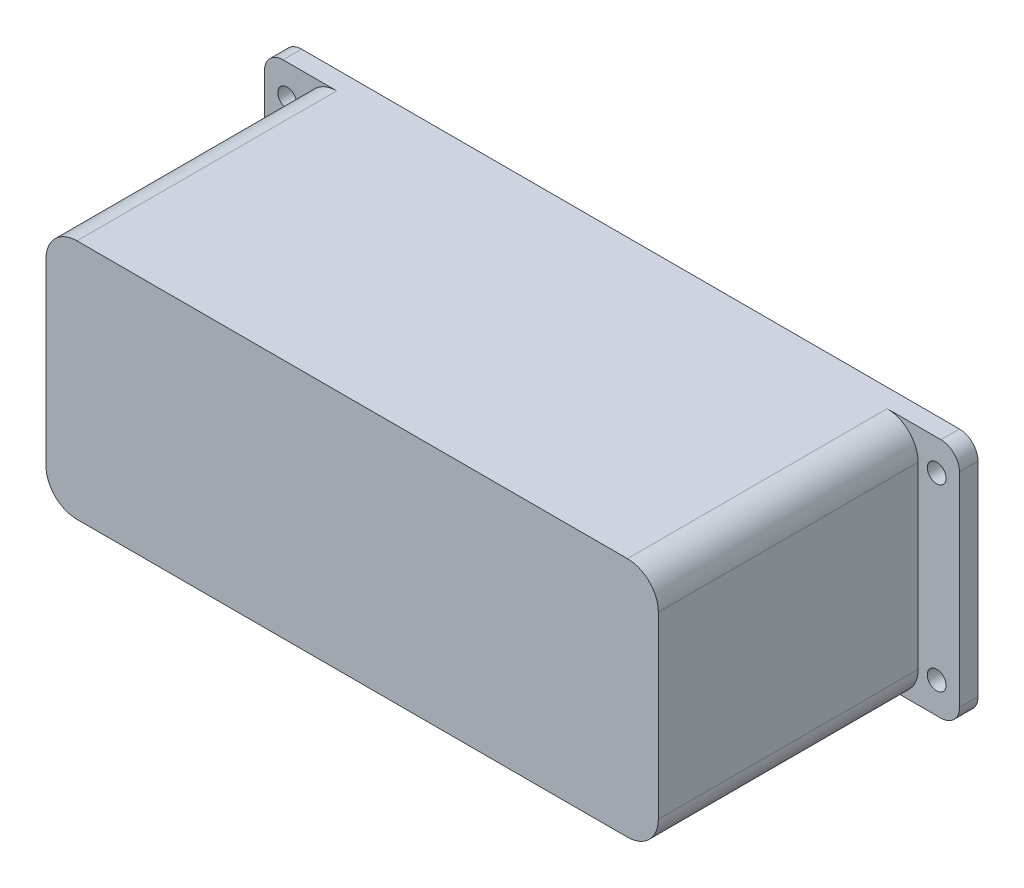
ISO-10303-21;
HEADER;
FILE_DESCRIPTION(('STEP AP214'),'2;1');
FILE_NAME('part.step','',(''),(''),'','','');
FILE_SCHEMA(('AUTOMOTIVE_DESIGN { 1 0 10303 214 1 1 1 1 }'));
ENDSEC;
DATA;
#1=APPLICATION_CONTEXT('core data for automotive mechanical design processes');
#2=APPLICATION_PROTOCOL_DEFINITION('international standard','automotive_design',2000,#1);
#3=PRODUCT_CONTEXT('',#1,'mechanical');
#4=PRODUCT('Part','Part','',(#3));
#5=PRODUCT_RELATED_PRODUCT_CATEGORY('part','',(#4));
#6=PRODUCT_DEFINITION_FORMATION('','',#4);
#7=PRODUCT_DEFINITION_CONTEXT('part definition',#1,'design');
#8=PRODUCT_DEFINITION('design','',#6,#7);
#9=PRODUCT_DEFINITION_SHAPE('','',#8);
#10=(LENGTH_UNIT() NAMED_UNIT(*) SI_UNIT(.MILLI.,.METRE.));
#11=(NAMED_UNIT(*) PLANE_ANGLE_UNIT() SI_UNIT($,.RADIAN.));
#12=(NAMED_UNIT(*) SI_UNIT($,.STERADIAN.) SOLID_ANGLE_UNIT());
#13=UNCERTAINTY_MEASURE_WITH_UNIT(LENGTH_MEASURE(1.E-05),#10,'distance_accuracy_value','');
#14=(GEOMETRIC_REPRESENTATION_CONTEXT(3) GLOBAL_UNCERTAINTY_ASSIGNED_CONTEXT((#13)) GLOBAL_UNIT_ASSIGNED_CONTEXT((#10,
#11,#12)) REPRESENTATION_CONTEXT('',''));
#15=CARTESIAN_POINT('',(0.,0.,0.));
#16=DIRECTION('',(0.,0.,1.));
#17=DIRECTION('',(1.,0.,0.));
#18=AXIS2_PLACEMENT_3D('',#15,#16,#17);
#19=CARTESIAN_POINT('',(76.5,19.5,7.));
#20=DIRECTION('',(0.,-1.,0.));
#21=DIRECTION('',(1.,0.,0.));
#22=AXIS2_PLACEMENT_3D('',#19,#20,#21);
#23=PLANE('',#22);
#24=DIRECTION('',(-1.,0.,0.));
#25=VECTOR('',#24,1.);
#26=CARTESIAN_POINT('',(76.5,19.5,7.));
#27=LINE('',#26,#25);
#28=CARTESIAN_POINT('',(53.18,19.5,7.));
#29=VERTEX_POINT('',#28);
#30=CARTESIAN_POINT('',(44.5,19.5,7.));
#31=VERTEX_POINT('',#30);
#32=EDGE_CURVE('E390',#29,#31,#27,.T.);
#33=ORIENTED_EDGE('',*,*,#32,.F.);
#34=DIRECTION('',(0.,0.,1.));
#35=VECTOR('',#34,1.);
#36=CARTESIAN_POINT('',(53.18,19.5,4.));
#37=LINE('',#36,#35);
#38=CARTESIAN_POINT('',(53.18,19.5,4.));
#39=VERTEX_POINT('',#38);
#40=EDGE_CURVE('E277',#29,#39,#37,.F.);
#41=ORIENTED_EDGE('',*,*,#40,.T.);
#42=DIRECTION('',(-1.,0.,0.));
#43=VECTOR('',#42,1.);
#44=CARTESIAN_POINT('',(76.5,19.5,4.));
#45=LINE('',#44,#43);
#46=CARTESIAN_POINT('',(-53.18,19.5,4.));
#47=VERTEX_POINT('',#46);
#48=EDGE_CURVE('E389',#39,#47,#45,.T.);
#49=ORIENTED_EDGE('',*,*,#48,.T.);
#50=DIRECTION('',(0.,0.,1.));
#51=VECTOR('',#50,1.);
#52=CARTESIAN_POINT('',(-53.18,19.5,7.));
#53=LINE('',#52,#51);
#54=CARTESIAN_POINT('',(-53.18,19.5,7.));
#55=VERTEX_POINT('',#54);
#56=EDGE_CURVE('E274',#47,#55,#53,.T.);
#57=ORIENTED_EDGE('',*,*,#56,.T.);
#58=CARTESIAN_POINT('',(-44.5,19.5,7.));
#59=VERTEX_POINT('',#58);
#60=EDGE_CURVE('E393',#59,#55,#27,.T.);
#61=ORIENTED_EDGE('',*,*,#60,.F.);
#62=DIRECTION('',(0.,0.,-1.));
#63=VECTOR('',#62,1.);
#64=CARTESIAN_POINT('',(-44.5,19.5,7.));
#65=LINE('',#64,#63);
#66=CARTESIAN_POINT('',(-44.5,19.5,49.));
#67=VERTEX_POINT('',#66);
#68=EDGE_CURVE('E217',#59,#67,#65,.F.);
#69=ORIENTED_EDGE('',*,*,#68,.T.);
#70=DIRECTION('',(-1.,0.,0.));
#71=VECTOR('',#70,1.);
#72=CARTESIAN_POINT('',(44.5,19.5,49.));
#73=LINE('',#72,#71);
#74=CARTESIAN_POINT('',(44.5,19.5,49.));
#75=VERTEX_POINT('',#74);
#76=EDGE_CURVE('E200',#75,#67,#73,.T.);
#77=ORIENTED_EDGE('',*,*,#76,.F.);
#78=DIRECTION('',(0.,0.,-1.));
#79=VECTOR('',#78,1.);
#80=CARTESIAN_POINT('',(44.5,19.5,7.));
#81=LINE('',#80,#79);
#82=EDGE_CURVE('E214',#75,#31,#81,.T.);
#83=ORIENTED_EDGE('',*,*,#82,.T.);
#84=EDGE_LOOP('',(#33,#41,#49,#57,#61,#69,#77,#83));
#85=FACE_BOUND('',#84,.T.);
#86=ADVANCED_FACE('F36',(#85),#23,.F.);
#87=CARTESIAN_POINT('',(-76.5,-19.5,7.));
#88=DIRECTION('',(0.,1.,0.));
#89=DIRECTION('',(-1.,0.,0.));
#90=AXIS2_PLACEMENT_3D('',#87,#88,#89);
#91=PLANE('',#90);
#92=DIRECTION('',(1.,0.,0.));
#93=VECTOR('',#92,1.);
#94=CARTESIAN_POINT('',(-76.5,-19.5,4.));
#95=LINE('',#94,#93);
#96=CARTESIAN_POINT('',(-53.18,-19.5,4.));
#97=VERTEX_POINT('',#96);
#98=CARTESIAN_POINT('',(53.18,-19.5,4.));
#99=VERTEX_POINT('',#98);
#100=EDGE_CURVE('E398',#97,#99,#95,.T.);
#101=ORIENTED_EDGE('',*,*,#100,.T.);
#102=DIRECTION('',(0.,0.,1.));
#103=VECTOR('',#102,1.);
#104=CARTESIAN_POINT('',(53.18,-19.5,7.));
#105=LINE('',#104,#103);
#106=CARTESIAN_POINT('',(53.18,-19.5,7.));
#107=VERTEX_POINT('',#106);
#108=EDGE_CURVE('E254',#99,#107,#105,.T.);
#109=ORIENTED_EDGE('',*,*,#108,.T.);
#110=DIRECTION('',(1.,0.,0.));
#111=VECTOR('',#110,1.);
#112=CARTESIAN_POINT('',(-76.5,-19.5,7.));
#113=LINE('',#112,#111);
#114=CARTESIAN_POINT('',(44.5,-19.5,7.));
#115=VERTEX_POINT('',#114);
#116=EDGE_CURVE('E392',#115,#107,#113,.T.);
#117=ORIENTED_EDGE('',*,*,#116,.F.);
#118=DIRECTION('',(0.,0.,-1.));
#119=VECTOR('',#118,1.);
#120=CARTESIAN_POINT('',(44.5,-19.5,7.));
#121=LINE('',#120,#119);
#122=CARTESIAN_POINT('',(44.5,-19.5,49.));
#123=VERTEX_POINT('',#122);
#124=EDGE_CURVE('E225',#115,#123,#121,.F.);
#125=ORIENTED_EDGE('',*,*,#124,.T.);
#126=DIRECTION('',(1.,0.,0.));
#127=VECTOR('',#126,1.);
#128=CARTESIAN_POINT('',(-44.5,-19.5,49.));
#129=LINE('',#128,#127);
#130=CARTESIAN_POINT('',(-44.5,-19.5,49.));
#131=VERTEX_POINT('',#130);
#132=EDGE_CURVE('E301',#131,#123,#129,.T.);
#133=ORIENTED_EDGE('',*,*,#132,.F.);
#134=DIRECTION('',(0.,0.,-1.));
#135=VECTOR('',#134,1.);
#136=CARTESIAN_POINT('',(-44.5,-19.5,7.));
#137=LINE('',#136,#135);
#138=CARTESIAN_POINT('',(-44.5,-19.5,7.));
#139=VERTEX_POINT('',#138);
#140=EDGE_CURVE('E233',#131,#139,#137,.T.);
#141=ORIENTED_EDGE('',*,*,#140,.T.);
#142=CARTESIAN_POINT('',(-53.18,-19.5,7.));
#143=VERTEX_POINT('',#142);
#144=EDGE_CURVE('E394',#143,#139,#113,.T.);
#145=ORIENTED_EDGE('',*,*,#144,.F.);
#146=DIRECTION('',(0.,0.,1.));
#147=VECTOR('',#146,1.);
#148=CARTESIAN_POINT('',(-53.18,-19.5,7.));
#149=LINE('',#148,#147);
#150=EDGE_CURVE('E252',#143,#97,#149,.F.);
#151=ORIENTED_EDGE('',*,*,#150,.T.);
#152=EDGE_LOOP('',(#101,#109,#117,#125,#133,#141,#145,#151));
#153=FACE_BOUND('',#152,.T.);
#154=ADVANCED_FACE('F425',(#153),#91,.F.);
#155=CARTESIAN_POINT('',(49.5,-19.5,51.));
#156=DIRECTION('',(-1.,0.,0.));
#157=DIRECTION('',(0.,0.,1.));
#158=AXIS2_PLACEMENT_3D('',#155,#156,#157);
#159=PLANE('',#158);
#160=DIRECTION('',(0.,1.,0.));
#161=VECTOR('',#160,1.);
#162=CARTESIAN_POINT('',(49.5,-19.5,7.));
#163=LINE('',#162,#161);
#164=CARTESIAN_POINT('',(49.5,-14.5,7.));
#165=VERTEX_POINT('',#164);
#166=CARTESIAN_POINT('',(49.5,14.5,7.));
#167=VERTEX_POINT('',#166);
#168=EDGE_CURVE('E383',#165,#167,#163,.T.);
#169=ORIENTED_EDGE('',*,*,#168,.T.);
#170=DIRECTION('',(0.,0.,-1.));
#171=VECTOR('',#170,1.);
#172=CARTESIAN_POINT('',(49.5,14.5,51.));
#173=LINE('',#172,#171);
#174=CARTESIAN_POINT('',(49.5,14.5,49.));
#175=VERTEX_POINT('',#174);
#176=EDGE_CURVE('E236',#167,#175,#173,.F.);
#177=ORIENTED_EDGE('',*,*,#176,.T.);
#178=DIRECTION('',(0.,1.,0.));
#179=VECTOR('',#178,1.);
#180=CARTESIAN_POINT('',(49.5,-14.5,49.));
#181=LINE('',#180,#179);
#182=CARTESIAN_POINT('',(49.5,-14.5,49.));
#183=VERTEX_POINT('',#182);
#184=EDGE_CURVE('E203',#183,#175,#181,.T.);
#185=ORIENTED_EDGE('',*,*,#184,.F.);
#186=DIRECTION('',(0.,0.,-1.));
#187=VECTOR('',#186,1.);
#188=CARTESIAN_POINT('',(49.5,-14.5,51.));
#189=LINE('',#188,#187);
#190=EDGE_CURVE('E238',#183,#165,#189,.T.);
#191=ORIENTED_EDGE('',*,*,#190,.T.);
#192=EDGE_LOOP('',(#169,#177,#185,#191));
#193=FACE_BOUND('',#192,.T.);
#194=ADVANCED_FACE('F434',(#193),#159,.F.);
#195=CARTESIAN_POINT('',(-49.5,-19.5,51.));
#196=DIRECTION('',(1.,0.,0.));
#197=DIRECTION('',(0.,0.,-1.));
#198=AXIS2_PLACEMENT_3D('',#195,#196,#197);
#199=PLANE('',#198);
#200=DIRECTION('',(0.,-1.,0.));
#201=VECTOR('',#200,1.);
#202=CARTESIAN_POINT('',(-49.5,14.5,49.));
#203=LINE('',#202,#201);
#204=CARTESIAN_POINT('',(-49.5,14.5,49.));
#205=VERTEX_POINT('',#204);
#206=CARTESIAN_POINT('',(-49.5,-14.5,49.));
#207=VERTEX_POINT('',#206);
#208=EDGE_CURVE('E297',#205,#207,#203,.T.);
#209=ORIENTED_EDGE('',*,*,#208,.F.);
#210=DIRECTION('',(0.,0.,-1.));
#211=VECTOR('',#210,1.);
#212=CARTESIAN_POINT('',(-49.5,14.5,51.));
#213=LINE('',#212,#211);
#214=CARTESIAN_POINT('',(-49.5,14.5,7.));
#215=VERTEX_POINT('',#214);
#216=EDGE_CURVE('E223',#205,#215,#213,.T.);
#217=ORIENTED_EDGE('',*,*,#216,.T.);
#218=DIRECTION('',(0.,-1.,0.));
#219=VECTOR('',#218,1.);
#220=CARTESIAN_POINT('',(-49.5,-19.5,7.));
#221=LINE('',#220,#219);
#222=CARTESIAN_POINT('',(-49.5,-14.5,7.));
#223=VERTEX_POINT('',#222);
#224=EDGE_CURVE('E385',#215,#223,#221,.T.);
#225=ORIENTED_EDGE('',*,*,#224,.T.);
#226=DIRECTION('',(0.,0.,-1.));
#227=VECTOR('',#226,1.);
#228=CARTESIAN_POINT('',(-49.5,-14.5,51.));
#229=LINE('',#228,#227);
#230=EDGE_CURVE('E227',#223,#207,#229,.F.);
#231=ORIENTED_EDGE('',*,*,#230,.T.);
#232=EDGE_LOOP('',(#209,#217,#225,#231));
#233=FACE_BOUND('',#232,.T.);
#234=ADVANCED_FACE('F414',(#233),#199,.F.);
#235=CARTESIAN_POINT('',(-44.5,14.5,51.));
#236=DIRECTION('',(0.,0.,-1.));
#237=DIRECTION('',(-1.,0.,0.));
#238=AXIS2_PLACEMENT_3D('',#235,#236,#237);
#239=CYLINDRICAL_SURFACE('',#238,5.);
#240=ORIENTED_EDGE('',*,*,#216,.F.);
#241=CARTESIAN_POINT('',(-44.5,14.5,49.));
#242=DIRECTION('',(0.,0.,1.));
#243=DIRECTION('',(1.,0.,0.));
#244=AXIS2_PLACEMENT_3D('',#241,#242,#243);
#245=CIRCLE('',#244,5.);
#246=EDGE_CURVE('E218',#67,#205,#245,.T.);
#247=ORIENTED_EDGE('',*,*,#246,.F.);
#248=ORIENTED_EDGE('',*,*,#68,.F.);
#249=CARTESIAN_POINT('',(-44.5,14.5,7.));
#250=DIRECTION('',(0.,0.,1.));
#251=DIRECTION('',(1.,0.,0.));
#252=AXIS2_PLACEMENT_3D('',#249,#250,#251);
#253=CIRCLE('',#252,5.);
#254=EDGE_CURVE('E240',#215,#59,#253,.F.);
#255=ORIENTED_EDGE('',*,*,#254,.F.);
#256=EDGE_LOOP('',(#240,#247,#248,#255));
#257=FACE_BOUND('',#256,.T.);
#258=ADVANCED_FACE('F463',(#257),#239,.T.);
#259=CARTESIAN_POINT('',(-44.5,-14.5,7.));
#260=DIRECTION('',(0.,0.,-1.));
#261=DIRECTION('',(-1.,0.,0.));
#262=AXIS2_PLACEMENT_3D('',#259,#260,#261);
#263=CYLINDRICAL_SURFACE('',#262,5.);
#264=ORIENTED_EDGE('',*,*,#140,.F.);
#265=CARTESIAN_POINT('',(-44.5,-14.5,49.));
#266=DIRECTION('',(0.,0.,1.));
#267=DIRECTION('',(1.,0.,0.));
#268=AXIS2_PLACEMENT_3D('',#265,#266,#267);
#269=CIRCLE('',#268,5.);
#270=EDGE_CURVE('E299',#207,#131,#269,.T.);
#271=ORIENTED_EDGE('',*,*,#270,.F.);
#272=ORIENTED_EDGE('',*,*,#230,.F.);
#273=CARTESIAN_POINT('',(-44.5,-14.5,7.));
#274=DIRECTION('',(0.,0.,1.));
#275=DIRECTION('',(1.,0.,0.));
#276=AXIS2_PLACEMENT_3D('',#273,#274,#275);
#277=CIRCLE('',#276,5.);
#278=EDGE_CURVE('E243',#139,#223,#277,.F.);
#279=ORIENTED_EDGE('',*,*,#278,.F.);
#280=EDGE_LOOP('',(#264,#271,#272,#279));
#281=FACE_BOUND('',#280,.T.);
#282=ADVANCED_FACE('F421',(#281),#263,.T.);
#283=CARTESIAN_POINT('',(44.5,-14.5,51.));
#284=DIRECTION('',(0.,0.,-1.));
#285=DIRECTION('',(-1.,0.,0.));
#286=AXIS2_PLACEMENT_3D('',#283,#284,#285);
#287=CYLINDRICAL_SURFACE('',#286,5.);
#288=ORIENTED_EDGE('',*,*,#190,.F.);
#289=CARTESIAN_POINT('',(44.5,-14.5,49.));
#290=DIRECTION('',(0.,0.,1.));
#291=DIRECTION('',(1.,0.,0.));
#292=AXIS2_PLACEMENT_3D('',#289,#290,#291);
#293=CIRCLE('',#292,5.);
#294=EDGE_CURVE('E303',#123,#183,#293,.T.);
#295=ORIENTED_EDGE('',*,*,#294,.F.);
#296=ORIENTED_EDGE('',*,*,#124,.F.);
#297=CARTESIAN_POINT('',(44.5,-14.5,7.));
#298=DIRECTION('',(0.,0.,1.));
#299=DIRECTION('',(1.,0.,0.));
#300=AXIS2_PLACEMENT_3D('',#297,#298,#299);
#301=CIRCLE('',#300,5.);
#302=EDGE_CURVE('E245',#165,#115,#301,.F.);
#303=ORIENTED_EDGE('',*,*,#302,.F.);
#304=EDGE_LOOP('',(#288,#295,#296,#303));
#305=FACE_BOUND('',#304,.T.);
#306=ADVANCED_FACE('F431',(#305),#287,.T.);
#307=CARTESIAN_POINT('',(44.5,14.5,7.));
#308=DIRECTION('',(0.,0.,-1.));
#309=DIRECTION('',(-1.,0.,0.));
#310=AXIS2_PLACEMENT_3D('',#307,#308,#309);
#311=CYLINDRICAL_SURFACE('',#310,5.);
#312=ORIENTED_EDGE('',*,*,#82,.F.);
#313=CARTESIAN_POINT('',(44.5,14.5,49.));
#314=DIRECTION('',(0.,0.,1.));
#315=DIRECTION('',(1.,0.,0.));
#316=AXIS2_PLACEMENT_3D('',#313,#314,#315);
#317=CIRCLE('',#316,5.);
#318=EDGE_CURVE('E197',#175,#75,#317,.T.);
#319=ORIENTED_EDGE('',*,*,#318,.F.);
#320=ORIENTED_EDGE('',*,*,#176,.F.);
#321=CARTESIAN_POINT('',(44.5,14.5,7.));
#322=DIRECTION('',(0.,0.,1.));
#323=DIRECTION('',(1.,0.,0.));
#324=AXIS2_PLACEMENT_3D('',#321,#322,#323);
#325=CIRCLE('',#324,5.);
#326=EDGE_CURVE('E222',#31,#167,#325,.F.);
#327=ORIENTED_EDGE('',*,*,#326,.F.);
#328=EDGE_LOOP('',(#312,#319,#320,#327));
#329=FACE_BOUND('',#328,.T.);
#330=ADVANCED_FACE('F220',(#329),#311,.T.);
#331=CARTESIAN_POINT('',(76.5,-16.5,7.));
#332=DIRECTION('',(0.,0.,1.));
#333=DIRECTION('',(1.,0.,0.));
#334=AXIS2_PLACEMENT_3D('',#331,#332,#333);
#335=PLANE('',#334);
#336=ORIENTED_EDGE('',*,*,#116,.T.);
#337=CARTESIAN_POINT('',(53.18,-16.5,7.));
#338=DIRECTION('',(0.,0.,1.));
#339=DIRECTION('',(1.,0.,0.));
#340=AXIS2_PLACEMENT_3D('',#337,#338,#339);
#341=CIRCLE('',#340,3.);
#342=CARTESIAN_POINT('',(56.18,-16.5,7.));
#343=VERTEX_POINT('',#342);
#344=EDGE_CURVE('E259',#107,#343,#341,.T.);
#345=ORIENTED_EDGE('',*,*,#344,.T.);
#346=DIRECTION('',(0.,-1.,0.));
#347=VECTOR('',#346,1.);
#348=CARTESIAN_POINT('',(56.18,7.5,7.));
#349=LINE('',#348,#347);
#350=CARTESIAN_POINT('',(56.18,16.5,7.));
#351=VERTEX_POINT('',#350);
#352=EDGE_CURVE('E208',#351,#343,#349,.T.);
#353=ORIENTED_EDGE('',*,*,#352,.F.);
#354=CARTESIAN_POINT('',(53.18,16.5,7.));
#355=DIRECTION('',(0.,0.,1.));
#356=DIRECTION('',(1.,0.,0.));
#357=AXIS2_PLACEMENT_3D('',#354,#355,#356);
#358=CIRCLE('',#357,3.);
#359=EDGE_CURVE('E257',#351,#29,#358,.T.);
#360=ORIENTED_EDGE('',*,*,#359,.T.);
#361=ORIENTED_EDGE('',*,*,#32,.T.);
#362=ORIENTED_EDGE('',*,*,#326,.T.);
#363=ORIENTED_EDGE('',*,*,#168,.F.);
#364=ORIENTED_EDGE('',*,*,#302,.T.);
#365=EDGE_LOOP('',(#336,#345,#353,#360,#361,#362,#363,#364));
#366=FACE_BOUND('',#365,.T.);
#367=CARTESIAN_POINT('',(52.5,14.5,7.));
#368=DIRECTION('',(0.,0.,1.));
#369=DIRECTION('',(1.,0.,0.));
#370=AXIS2_PLACEMENT_3D('',#367,#368,#369);
#371=CIRCLE('',#370,1.52);
#372=CARTESIAN_POINT('',(54.02,14.5,7.));
#373=VERTEX_POINT('',#372);
#374=EDGE_CURVE('E355',#373,#373,#371,.T.);
#375=ORIENTED_EDGE('',*,*,#374,.F.);
#376=EDGE_LOOP('',(#375));
#377=FACE_BOUND('',#376,.T.);
#378=CARTESIAN_POINT('',(52.5,-14.5,7.));
#379=DIRECTION('',(0.,0.,1.));
#380=DIRECTION('',(1.,0.,0.));
#381=AXIS2_PLACEMENT_3D('',#378,#379,#380);
#382=CIRCLE('',#381,1.52);
#383=CARTESIAN_POINT('',(54.02,-14.5,7.));
#384=VERTEX_POINT('',#383);
#385=EDGE_CURVE('E373',#384,#384,#382,.T.);
#386=ORIENTED_EDGE('',*,*,#385,.F.);
#387=EDGE_LOOP('',(#386));
#388=FACE_BOUND('',#387,.T.);
#389=ADVANCED_FACE('F436',(#366,#377,#388),#335,.T.);
#390=ORIENTED_EDGE('',*,*,#60,.T.);
#391=CARTESIAN_POINT('',(-53.18,16.5,7.));
#392=DIRECTION('',(0.,0.,1.));
#393=DIRECTION('',(1.,0.,0.));
#394=AXIS2_PLACEMENT_3D('',#391,#392,#393);
#395=CIRCLE('',#394,3.);
#396=CARTESIAN_POINT('',(-56.18,16.5,7.));
#397=VERTEX_POINT('',#396);
#398=EDGE_CURVE('E51',#55,#397,#395,.T.);
#399=ORIENTED_EDGE('',*,*,#398,.T.);
#400=DIRECTION('',(0.,1.,0.));
#401=VECTOR('',#400,1.);
#402=CARTESIAN_POINT('',(-56.18,19.5,7.));
#403=LINE('',#402,#401);
#404=CARTESIAN_POINT('',(-56.18,-16.5,7.));
#405=VERTEX_POINT('',#404);
#406=EDGE_CURVE('E283',#405,#397,#403,.T.);
#407=ORIENTED_EDGE('',*,*,#406,.F.);
#408=CARTESIAN_POINT('',(-53.18,-16.5,7.));
#409=DIRECTION('',(0.,0.,1.));
#410=DIRECTION('',(1.,0.,0.));
#411=AXIS2_PLACEMENT_3D('',#408,#409,#410);
#412=CIRCLE('',#411,3.);
#413=EDGE_CURVE('E59',#405,#143,#412,.T.);
#414=ORIENTED_EDGE('',*,*,#413,.T.);
#415=ORIENTED_EDGE('',*,*,#144,.T.);
#416=ORIENTED_EDGE('',*,*,#278,.T.);
#417=ORIENTED_EDGE('',*,*,#224,.F.);
#418=ORIENTED_EDGE('',*,*,#254,.T.);
#419=EDGE_LOOP('',(#390,#399,#407,#414,#415,#416,#417,#418));
#420=FACE_BOUND('',#419,.T.);
#421=CARTESIAN_POINT('',(-52.5,14.5,7.));
#422=DIRECTION('',(0.,0.,1.));
#423=DIRECTION('',(1.,0.,0.));
#424=AXIS2_PLACEMENT_3D('',#421,#422,#423);
#425=CIRCLE('',#424,1.52);
#426=CARTESIAN_POINT('',(-50.98,14.5,7.));
#427=VERTEX_POINT('',#426);
#428=EDGE_CURVE('E374',#427,#427,#425,.T.);
#429=ORIENTED_EDGE('',*,*,#428,.F.);
#430=EDGE_LOOP('',(#429));
#431=FACE_BOUND('',#430,.T.);
#432=CARTESIAN_POINT('',(-52.5,-14.5,7.));
#433=DIRECTION('',(0.,0.,1.));
#434=DIRECTION('',(1.,0.,0.));
#435=AXIS2_PLACEMENT_3D('',#432,#433,#434);
#436=CIRCLE('',#435,1.52);
#437=CARTESIAN_POINT('',(-50.98,-14.5,7.));
#438=VERTEX_POINT('',#437);
#439=EDGE_CURVE('E377',#438,#438,#436,.T.);
#440=ORIENTED_EDGE('',*,*,#439,.F.);
#441=EDGE_LOOP('',(#440));
#442=FACE_BOUND('',#441,.T.);
#443=ADVANCED_FACE('F286',(#420,#431,#442),#335,.T.);
#444=CARTESIAN_POINT('',(76.5,-16.5,4.));
#445=DIRECTION('',(0.,0.,1.));
#446=DIRECTION('',(1.,0.,0.));
#447=AXIS2_PLACEMENT_3D('',#444,#445,#446);
#448=PLANE('',#447);
#449=DIRECTION('',(0.,-1.,0.));
#450=VECTOR('',#449,1.);
#451=CARTESIAN_POINT('',(56.18,7.5,4.));
#452=LINE('',#451,#450);
#453=CARTESIAN_POINT('',(56.18,16.5,4.));
#454=VERTEX_POINT('',#453);
#455=CARTESIAN_POINT('',(56.18,-16.5,4.));
#456=VERTEX_POINT('',#455);
#457=EDGE_CURVE('E289',#454,#456,#452,.T.);
#458=ORIENTED_EDGE('',*,*,#457,.T.);
#459=CARTESIAN_POINT('',(53.18,-16.5,4.));
#460=DIRECTION('',(0.,0.,1.));
#461=DIRECTION('',(1.,0.,0.));
#462=AXIS2_PLACEMENT_3D('',#459,#460,#461);
#463=CIRCLE('',#462,3.);
#464=EDGE_CURVE('E272',#456,#99,#463,.F.);
#465=ORIENTED_EDGE('',*,*,#464,.T.);
#466=ORIENTED_EDGE('',*,*,#100,.F.);
#467=CARTESIAN_POINT('',(-53.18,-16.5,4.));
#468=DIRECTION('',(0.,0.,1.));
#469=DIRECTION('',(1.,0.,0.));
#470=AXIS2_PLACEMENT_3D('',#467,#468,#469);
#471=CIRCLE('',#470,3.);
#472=CARTESIAN_POINT('',(-56.18,-16.5,4.));
#473=VERTEX_POINT('',#472);
#474=EDGE_CURVE('E266',#97,#473,#471,.F.);
#475=ORIENTED_EDGE('',*,*,#474,.T.);
#476=DIRECTION('',(0.,1.,0.));
#477=VECTOR('',#476,1.);
#478=CARTESIAN_POINT('',(-56.18,-16.5,4.));
#479=LINE('',#478,#477);
#480=CARTESIAN_POINT('',(-56.18,16.5,4.));
#481=VERTEX_POINT('',#480);
#482=EDGE_CURVE('E249',#473,#481,#479,.T.);
#483=ORIENTED_EDGE('',*,*,#482,.T.);
#484=CARTESIAN_POINT('',(-53.18,16.5,4.));
#485=DIRECTION('',(0.,0.,1.));
#486=DIRECTION('',(1.,0.,0.));
#487=AXIS2_PLACEMENT_3D('',#484,#485,#486);
#488=CIRCLE('',#487,3.);
#489=EDGE_CURVE('E268',#481,#47,#488,.F.);
#490=ORIENTED_EDGE('',*,*,#489,.T.);
#491=ORIENTED_EDGE('',*,*,#48,.F.);
#492=CARTESIAN_POINT('',(53.18,16.5,4.));
#493=DIRECTION('',(0.,0.,1.));
#494=DIRECTION('',(1.,0.,0.));
#495=AXIS2_PLACEMENT_3D('',#492,#493,#494);
#496=CIRCLE('',#495,3.);
#497=EDGE_CURVE('E270',#39,#454,#496,.F.);
#498=ORIENTED_EDGE('',*,*,#497,.T.);
#499=EDGE_LOOP('',(#458,#465,#466,#475,#483,#490,#491,#498));
#500=FACE_BOUND('',#499,.T.);
#501=CARTESIAN_POINT('',(-52.5,14.5,4.));
#502=DIRECTION('',(0.,0.,1.));
#503=DIRECTION('',(1.,0.,0.));
#504=AXIS2_PLACEMENT_3D('',#501,#502,#503);
#505=CIRCLE('',#504,1.52);
#506=CARTESIAN_POINT('',(-50.98,14.5,4.));
#507=VERTEX_POINT('',#506);
#508=EDGE_CURVE('E386',#507,#507,#505,.T.);
#509=ORIENTED_EDGE('',*,*,#508,.T.);
#510=EDGE_LOOP('',(#509));
#511=FACE_BOUND('',#510,.T.);
#512=CARTESIAN_POINT('',(52.5,-14.5,4.));
#513=DIRECTION('',(0.,0.,1.));
#514=DIRECTION('',(1.,0.,0.));
#515=AXIS2_PLACEMENT_3D('',#512,#513,#514);
#516=CIRCLE('',#515,1.52);
#517=CARTESIAN_POINT('',(54.02,-14.5,4.));
#518=VERTEX_POINT('',#517);
#519=EDGE_CURVE('E406',#518,#518,#516,.T.);
#520=ORIENTED_EDGE('',*,*,#519,.T.);
#521=EDGE_LOOP('',(#520));
#522=FACE_BOUND('',#521,.T.);
#523=CARTESIAN_POINT('',(52.5,14.5,4.));
#524=DIRECTION('',(0.,0.,1.));
#525=DIRECTION('',(1.,0.,0.));
#526=AXIS2_PLACEMENT_3D('',#523,#524,#525);
#527=CIRCLE('',#526,1.52);
#528=CARTESIAN_POINT('',(54.02,14.5,4.));
#529=VERTEX_POINT('',#528);
#530=EDGE_CURVE('E403',#529,#529,#527,.T.);
#531=ORIENTED_EDGE('',*,*,#530,.T.);
#532=EDGE_LOOP('',(#531));
#533=FACE_BOUND('',#532,.T.);
#534=CARTESIAN_POINT('',(-52.5,-14.5,4.));
#535=DIRECTION('',(0.,0.,1.));
#536=DIRECTION('',(1.,0.,0.));
#537=AXIS2_PLACEMENT_3D('',#534,#535,#536);
#538=CIRCLE('',#537,1.52);
#539=CARTESIAN_POINT('',(-50.98,-14.5,4.));
#540=VERTEX_POINT('',#539);
#541=EDGE_CURVE('E382',#540,#540,#538,.T.);
#542=ORIENTED_EDGE('',*,*,#541,.T.);
#543=EDGE_LOOP('',(#542));
#544=FACE_BOUND('',#543,.T.);
#545=CARTESIAN_POINT('',(44.5,-14.5,4.));
#546=DIRECTION('',(0.,0.,-1.));
#547=DIRECTION('',(-1.,0.,0.));
#548=AXIS2_PLACEMENT_3D('',#545,#546,#547);
#549=CIRCLE('',#548,3.68);
#550=CARTESIAN_POINT('',(48.18,-14.5,4.));
#551=VERTEX_POINT('',#550);
#552=CARTESIAN_POINT('',(44.5,-18.18,4.));
#553=VERTEX_POINT('',#552);
#554=EDGE_CURVE('E336',#551,#553,#549,.T.);
#555=ORIENTED_EDGE('',*,*,#554,.F.);
#556=DIRECTION('',(0.,-1.,0.));
#557=VECTOR('',#556,1.);
#558=CARTESIAN_POINT('',(48.18,14.5,4.));
#559=LINE('',#558,#557);
#560=CARTESIAN_POINT('',(48.18,14.5,4.));
#561=VERTEX_POINT('',#560);
#562=EDGE_CURVE('E334',#561,#551,#559,.T.);
#563=ORIENTED_EDGE('',*,*,#562,.F.);
#564=CARTESIAN_POINT('',(44.5,14.5,4.));
#565=DIRECTION('',(0.,0.,-1.));
#566=DIRECTION('',(-1.,0.,0.));
#567=AXIS2_PLACEMENT_3D('',#564,#565,#566);
#568=CIRCLE('',#567,3.68);
#569=CARTESIAN_POINT('',(44.5,18.18,4.));
#570=VERTEX_POINT('',#569);
#571=EDGE_CURVE('E306',#570,#561,#568,.T.);
#572=ORIENTED_EDGE('',*,*,#571,.F.);
#573=DIRECTION('',(1.,0.,0.));
#574=VECTOR('',#573,1.);
#575=CARTESIAN_POINT('',(-44.5,18.18,4.));
#576=LINE('',#575,#574);
#577=CARTESIAN_POINT('',(-44.5,18.18,4.));
#578=VERTEX_POINT('',#577);
#579=EDGE_CURVE('E311',#578,#570,#576,.T.);
#580=ORIENTED_EDGE('',*,*,#579,.F.);
#581=CARTESIAN_POINT('',(-44.5,14.5,4.));
#582=DIRECTION('',(0.,0.,-1.));
#583=DIRECTION('',(-1.,0.,0.));
#584=AXIS2_PLACEMENT_3D('',#581,#582,#583);
#585=CIRCLE('',#584,3.68);
#586=CARTESIAN_POINT('',(-48.18,14.5,4.));
#587=VERTEX_POINT('',#586);
#588=EDGE_CURVE('E348',#587,#578,#585,.T.);
#589=ORIENTED_EDGE('',*,*,#588,.F.);
#590=DIRECTION('',(0.,1.,0.));
#591=VECTOR('',#590,1.);
#592=CARTESIAN_POINT('',(-48.18,-14.5,4.));
#593=LINE('',#592,#591);
#594=CARTESIAN_POINT('',(-48.18,-14.5,4.));
#595=VERTEX_POINT('',#594);
#596=EDGE_CURVE('E345',#595,#587,#593,.T.);
#597=ORIENTED_EDGE('',*,*,#596,.F.);
#598=CARTESIAN_POINT('',(-44.5,-14.5,4.));
#599=DIRECTION('',(0.,0.,-1.));
#600=DIRECTION('',(-1.,0.,0.));
#601=AXIS2_PLACEMENT_3D('',#598,#599,#600);
#602=CIRCLE('',#601,3.67999999999999);
#603=CARTESIAN_POINT('',(-44.5,-18.18,4.));
#604=VERTEX_POINT('',#603);
#605=EDGE_CURVE('E342',#604,#595,#602,.T.);
#606=ORIENTED_EDGE('',*,*,#605,.F.);
#607=DIRECTION('',(-1.,0.,0.));
#608=VECTOR('',#607,1.);
#609=CARTESIAN_POINT('',(44.5,-18.18,4.));
#610=LINE('',#609,#608);
#611=EDGE_CURVE('E339',#553,#604,#610,.T.);
#612=ORIENTED_EDGE('',*,*,#611,.F.);
#613=EDGE_LOOP('',(#555,#563,#572,#580,#589,#597,#606,#612));
#614=FACE_BOUND('',#613,.T.);
#615=ADVANCED_FACE('F447',(#500,#511,#522,#533,#544,#614),#448,.F.);
#616=CARTESIAN_POINT('',(-52.5,-14.5,-38.));
#617=DIRECTION('',(0.,0.,1.));
#618=DIRECTION('',(1.,0.,0.));
#619=AXIS2_PLACEMENT_3D('',#616,#617,#618);
#620=CYLINDRICAL_SURFACE('',#619,1.52);
#621=ORIENTED_EDGE('',*,*,#439,.T.);
#622=EDGE_LOOP('',(#621));
#623=FACE_BOUND('',#622,.T.);
#624=ORIENTED_EDGE('',*,*,#541,.F.);
#625=EDGE_LOOP('',(#624));
#626=FACE_BOUND('',#625,.T.);
#627=ADVANCED_FACE('F481',(#623,#626),#620,.F.);
#628=CARTESIAN_POINT('',(52.5,14.5,-38.));
#629=DIRECTION('',(0.,0.,1.));
#630=DIRECTION('',(1.,0.,0.));
#631=AXIS2_PLACEMENT_3D('',#628,#629,#630);
#632=CYLINDRICAL_SURFACE('',#631,1.52);
#633=ORIENTED_EDGE('',*,*,#374,.T.);
#634=EDGE_LOOP('',(#633));
#635=FACE_BOUND('',#634,.T.);
#636=ORIENTED_EDGE('',*,*,#530,.F.);
#637=EDGE_LOOP('',(#636));
#638=FACE_BOUND('',#637,.T.);
#639=ADVANCED_FACE('F488',(#635,#638),#632,.F.);
#640=CARTESIAN_POINT('',(52.5,-14.5,-38.));
#641=DIRECTION('',(0.,0.,1.));
#642=DIRECTION('',(1.,0.,0.));
#643=AXIS2_PLACEMENT_3D('',#640,#641,#642);
#644=CYLINDRICAL_SURFACE('',#643,1.52);
#645=ORIENTED_EDGE('',*,*,#385,.T.);
#646=EDGE_LOOP('',(#645));
#647=FACE_BOUND('',#646,.T.);
#648=ORIENTED_EDGE('',*,*,#519,.F.);
#649=EDGE_LOOP('',(#648));
#650=FACE_BOUND('',#649,.T.);
#651=ADVANCED_FACE('F490',(#647,#650),#644,.F.);
#652=CARTESIAN_POINT('',(-52.5,14.5,-38.));
#653=DIRECTION('',(0.,0.,1.));
#654=DIRECTION('',(1.,0.,0.));
#655=AXIS2_PLACEMENT_3D('',#652,#653,#654);
#656=CYLINDRICAL_SURFACE('',#655,1.52);
#657=ORIENTED_EDGE('',*,*,#428,.T.);
#658=EDGE_LOOP('',(#657));
#659=FACE_BOUND('',#658,.T.);
#660=ORIENTED_EDGE('',*,*,#508,.F.);
#661=EDGE_LOOP('',(#660));
#662=FACE_BOUND('',#661,.T.);
#663=ADVANCED_FACE('F493',(#659,#662),#656,.F.);
#664=CARTESIAN_POINT('',(44.5,14.5,47.));
#665=DIRECTION('',(0.,0.,-1.));
#666=DIRECTION('',(-1.,0.,0.));
#667=AXIS2_PLACEMENT_3D('',#664,#665,#666);
#668=CYLINDRICAL_SURFACE('',#667,3.68);
#669=ORIENTED_EDGE('',*,*,#571,.T.);
#670=DIRECTION('',(0.,0.,-1.));
#671=VECTOR('',#670,1.);
#672=CARTESIAN_POINT('',(48.18,14.5,47.));
#673=LINE('',#672,#671);
#674=CARTESIAN_POINT('',(48.18,14.5,47.));
#675=VERTEX_POINT('',#674);
#676=EDGE_CURVE('E332',#675,#561,#673,.T.);
#677=ORIENTED_EDGE('',*,*,#676,.F.);
#678=CARTESIAN_POINT('',(44.5,14.5,47.));
#679=DIRECTION('',(0.,0.,-1.));
#680=DIRECTION('',(-1.,0.,0.));
#681=AXIS2_PLACEMENT_3D('',#678,#679,#680);
#682=CIRCLE('',#681,3.68);
#683=CARTESIAN_POINT('',(44.5,18.18,47.));
#684=VERTEX_POINT('',#683);
#685=EDGE_CURVE('E307',#684,#675,#682,.T.);
#686=ORIENTED_EDGE('',*,*,#685,.F.);
#687=DIRECTION('',(0.,0.,-1.));
#688=VECTOR('',#687,1.);
#689=CARTESIAN_POINT('',(44.5,18.18,47.));
#690=LINE('',#689,#688);
#691=EDGE_CURVE('E353',#684,#570,#690,.T.);
#692=ORIENTED_EDGE('',*,*,#691,.T.);
#693=EDGE_LOOP('',(#669,#677,#686,#692));
#694=FACE_BOUND('',#693,.T.);
#695=ADVANCED_FACE('F497',(#694),#668,.F.);
#696=CARTESIAN_POINT('',(-44.5,18.18,47.));
#697=DIRECTION('',(0.,1.,0.));
#698=DIRECTION('',(0.,0.,1.));
#699=AXIS2_PLACEMENT_3D('',#696,#697,#698);
#700=PLANE('',#699);
#701=ORIENTED_EDGE('',*,*,#579,.T.);
#702=ORIENTED_EDGE('',*,*,#691,.F.);
#703=DIRECTION('',(1.,0.,0.));
#704=VECTOR('',#703,1.);
#705=CARTESIAN_POINT('',(-44.5,18.18,47.));
#706=LINE('',#705,#704);
#707=CARTESIAN_POINT('',(-44.5,18.18,47.));
#708=VERTEX_POINT('',#707);
#709=EDGE_CURVE('E329',#708,#684,#706,.T.);
#710=ORIENTED_EDGE('',*,*,#709,.F.);
#711=DIRECTION('',(0.,0.,-1.));
#712=VECTOR('',#711,1.);
#713=CARTESIAN_POINT('',(-44.5,18.18,47.));
#714=LINE('',#713,#712);
#715=EDGE_CURVE('E356',#708,#578,#714,.T.);
#716=ORIENTED_EDGE('',*,*,#715,.T.);
#717=EDGE_LOOP('',(#701,#702,#710,#716));
#718=FACE_BOUND('',#717,.T.);
#719=ADVANCED_FACE('F504',(#718),#700,.F.);
#720=CARTESIAN_POINT('',(-44.5,14.5,47.));
#721=DIRECTION('',(0.,0.,-1.));
#722=DIRECTION('',(-1.,0.,0.));
#723=AXIS2_PLACEMENT_3D('',#720,#721,#722);
#724=CYLINDRICAL_SURFACE('',#723,3.68);
#725=ORIENTED_EDGE('',*,*,#588,.T.);
#726=ORIENTED_EDGE('',*,*,#715,.F.);
#727=CARTESIAN_POINT('',(-44.5,14.5,47.));
#728=DIRECTION('',(0.,0.,-1.));
#729=DIRECTION('',(-1.,0.,0.));
#730=AXIS2_PLACEMENT_3D('',#727,#728,#729);
#731=CIRCLE('',#730,3.68);
#732=CARTESIAN_POINT('',(-48.18,14.5,47.));
#733=VERTEX_POINT('',#732);
#734=EDGE_CURVE('E326',#733,#708,#731,.T.);
#735=ORIENTED_EDGE('',*,*,#734,.F.);
#736=DIRECTION('',(0.,0.,-1.));
#737=VECTOR('',#736,1.);
#738=CARTESIAN_POINT('',(-48.18,14.5,47.));
#739=LINE('',#738,#737);
#740=EDGE_CURVE('E358',#733,#587,#739,.T.);
#741=ORIENTED_EDGE('',*,*,#740,.T.);
#742=EDGE_LOOP('',(#725,#726,#735,#741));
#743=FACE_BOUND('',#742,.T.);
#744=ADVANCED_FACE('F526',(#743),#724,.F.);
#745=CARTESIAN_POINT('',(-48.18,-14.5,47.));
#746=DIRECTION('',(-1.,0.,0.));
#747=DIRECTION('',(0.,0.,1.));
#748=AXIS2_PLACEMENT_3D('',#745,#746,#747);
#749=PLANE('',#748);
#750=ORIENTED_EDGE('',*,*,#596,.T.);
#751=ORIENTED_EDGE('',*,*,#740,.F.);
#752=DIRECTION('',(0.,1.,0.));
#753=VECTOR('',#752,1.);
#754=CARTESIAN_POINT('',(-48.18,-14.5,47.));
#755=LINE('',#754,#753);
#756=CARTESIAN_POINT('',(-48.18,-14.5,47.));
#757=VERTEX_POINT('',#756);
#758=EDGE_CURVE('E323',#757,#733,#755,.T.);
#759=ORIENTED_EDGE('',*,*,#758,.F.);
#760=DIRECTION('',(0.,0.,-1.));
#761=VECTOR('',#760,1.);
#762=CARTESIAN_POINT('',(-48.18,-14.5,47.));
#763=LINE('',#762,#761);
#764=EDGE_CURVE('E360',#757,#595,#763,.T.);
#765=ORIENTED_EDGE('',*,*,#764,.T.);
#766=EDGE_LOOP('',(#750,#751,#759,#765));
#767=FACE_BOUND('',#766,.T.);
#768=ADVANCED_FACE('F522',(#767),#749,.F.);
#769=CARTESIAN_POINT('',(-44.5,-14.5,47.));
#770=DIRECTION('',(0.,0.,-1.));
#771=DIRECTION('',(-1.,0.,0.));
#772=AXIS2_PLACEMENT_3D('',#769,#770,#771);
#773=CYLINDRICAL_SURFACE('',#772,3.67999999999999);
#774=ORIENTED_EDGE('',*,*,#605,.T.);
#775=ORIENTED_EDGE('',*,*,#764,.F.);
#776=CARTESIAN_POINT('',(-44.5,-14.5,47.));
#777=DIRECTION('',(0.,0.,-1.));
#778=DIRECTION('',(-1.,0.,0.));
#779=AXIS2_PLACEMENT_3D('',#776,#777,#778);
#780=CIRCLE('',#779,3.67999999999999);
#781=CARTESIAN_POINT('',(-44.5,-18.18,47.));
#782=VERTEX_POINT('',#781);
#783=EDGE_CURVE('E320',#782,#757,#780,.T.);
#784=ORIENTED_EDGE('',*,*,#783,.F.);
#785=DIRECTION('',(0.,0.,-1.));
#786=VECTOR('',#785,1.);
#787=CARTESIAN_POINT('',(-44.5,-18.18,47.));
#788=LINE('',#787,#786);
#789=EDGE_CURVE('E362',#782,#604,#788,.T.);
#790=ORIENTED_EDGE('',*,*,#789,.T.);
#791=EDGE_LOOP('',(#774,#775,#784,#790));
#792=FACE_BOUND('',#791,.T.);
#793=ADVANCED_FACE('F518',(#792),#773,.F.);
#794=CARTESIAN_POINT('',(44.5,-18.18,47.));
#795=DIRECTION('',(0.,-1.,0.));
#796=DIRECTION('',(0.,0.,-1.));
#797=AXIS2_PLACEMENT_3D('',#794,#795,#796);
#798=PLANE('',#797);
#799=ORIENTED_EDGE('',*,*,#611,.T.);
#800=ORIENTED_EDGE('',*,*,#789,.F.);
#801=DIRECTION('',(-1.,0.,0.));
#802=VECTOR('',#801,1.);
#803=CARTESIAN_POINT('',(44.5,-18.18,47.));
#804=LINE('',#803,#802);
#805=CARTESIAN_POINT('',(44.5,-18.18,47.));
#806=VERTEX_POINT('',#805);
#807=EDGE_CURVE('E317',#806,#782,#804,.T.);
#808=ORIENTED_EDGE('',*,*,#807,.F.);
#809=DIRECTION('',(0.,0.,-1.));
#810=VECTOR('',#809,1.);
#811=CARTESIAN_POINT('',(44.5,-18.18,47.));
#812=LINE('',#811,#810);
#813=EDGE_CURVE('E364',#806,#553,#812,.T.);
#814=ORIENTED_EDGE('',*,*,#813,.T.);
#815=EDGE_LOOP('',(#799,#800,#808,#814));
#816=FACE_BOUND('',#815,.T.);
#817=ADVANCED_FACE('F514',(#816),#798,.F.);
#818=CARTESIAN_POINT('',(44.5,-14.5,47.));
#819=DIRECTION('',(0.,0.,-1.));
#820=DIRECTION('',(-1.,0.,0.));
#821=AXIS2_PLACEMENT_3D('',#818,#819,#820);
#822=CYLINDRICAL_SURFACE('',#821,3.68);
#823=ORIENTED_EDGE('',*,*,#554,.T.);
#824=ORIENTED_EDGE('',*,*,#813,.F.);
#825=CARTESIAN_POINT('',(44.5,-14.5,47.));
#826=DIRECTION('',(0.,0.,-1.));
#827=DIRECTION('',(-1.,0.,0.));
#828=AXIS2_PLACEMENT_3D('',#825,#826,#827);
#829=CIRCLE('',#828,3.68);
#830=CARTESIAN_POINT('',(48.18,-14.5,47.));
#831=VERTEX_POINT('',#830);
#832=EDGE_CURVE('E314',#831,#806,#829,.T.);
#833=ORIENTED_EDGE('',*,*,#832,.F.);
#834=DIRECTION('',(0.,0.,-1.));
#835=VECTOR('',#834,1.);
#836=CARTESIAN_POINT('',(48.18,-14.5,47.));
#837=LINE('',#836,#835);
#838=EDGE_CURVE('E366',#831,#551,#837,.T.);
#839=ORIENTED_EDGE('',*,*,#838,.T.);
#840=EDGE_LOOP('',(#823,#824,#833,#839));
#841=FACE_BOUND('',#840,.T.);
#842=ADVANCED_FACE('F510',(#841),#822,.F.);
#843=CARTESIAN_POINT('',(48.18,14.5,47.));
#844=DIRECTION('',(1.,0.,0.));
#845=DIRECTION('',(0.,0.,-1.));
#846=AXIS2_PLACEMENT_3D('',#843,#844,#845);
#847=PLANE('',#846);
#848=ORIENTED_EDGE('',*,*,#562,.T.);
#849=ORIENTED_EDGE('',*,*,#838,.F.);
#850=DIRECTION('',(0.,-1.,0.));
#851=VECTOR('',#850,1.);
#852=CARTESIAN_POINT('',(48.18,14.5,47.));
#853=LINE('',#852,#851);
#854=EDGE_CURVE('E310',#675,#831,#853,.T.);
#855=ORIENTED_EDGE('',*,*,#854,.F.);
#856=ORIENTED_EDGE('',*,*,#676,.T.);
#857=EDGE_LOOP('',(#848,#849,#855,#856));
#858=FACE_BOUND('',#857,.T.);
#859=ADVANCED_FACE('F506',(#858),#847,.F.);
#860=CARTESIAN_POINT('',(44.5,14.5,47.));
#861=DIRECTION('',(0.,0.,-1.));
#862=DIRECTION('',(-1.,0.,0.));
#863=AXIS2_PLACEMENT_3D('',#860,#861,#862);
#864=PLANE('',#863);
#865=ORIENTED_EDGE('',*,*,#685,.T.);
#866=ORIENTED_EDGE('',*,*,#854,.T.);
#867=ORIENTED_EDGE('',*,*,#832,.T.);
#868=ORIENTED_EDGE('',*,*,#807,.T.);
#869=ORIENTED_EDGE('',*,*,#783,.T.);
#870=ORIENTED_EDGE('',*,*,#758,.T.);
#871=ORIENTED_EDGE('',*,*,#734,.T.);
#872=ORIENTED_EDGE('',*,*,#709,.T.);
#873=EDGE_LOOP('',(#865,#866,#867,#868,#869,#870,#871,#872));
#874=FACE_BOUND('',#873,.T.);
#875=ADVANCED_FACE('F509',(#874),#864,.T.);
#876=CARTESIAN_POINT('',(44.5,14.5,49.));
#877=DIRECTION('',(0.,0.,1.));
#878=DIRECTION('',(1.,0.,0.));
#879=AXIS2_PLACEMENT_3D('',#876,#877,#878);
#880=PLANE('',#879);
#881=ORIENTED_EDGE('',*,*,#318,.T.);
#882=ORIENTED_EDGE('',*,*,#76,.T.);
#883=ORIENTED_EDGE('',*,*,#246,.T.);
#884=ORIENTED_EDGE('',*,*,#208,.T.);
#885=ORIENTED_EDGE('',*,*,#270,.T.);
#886=ORIENTED_EDGE('',*,*,#132,.T.);
#887=ORIENTED_EDGE('',*,*,#294,.T.);
#888=ORIENTED_EDGE('',*,*,#184,.T.);
#889=EDGE_LOOP('',(#881,#882,#883,#884,#885,#886,#887,#888));
#890=FACE_BOUND('',#889,.T.);
#891=ADVANCED_FACE('F199',(#890),#880,.T.);
#892=CARTESIAN_POINT('',(56.18,7.5,24.));
#893=DIRECTION('',(1.,0.,0.));
#894=DIRECTION('',(0.,0.,-1.));
#895=AXIS2_PLACEMENT_3D('',#892,#893,#894);
#896=PLANE('',#895);
#897=ORIENTED_EDGE('',*,*,#352,.T.);
#898=DIRECTION('',(0.,0.,1.));
#899=VECTOR('',#898,1.);
#900=CARTESIAN_POINT('',(56.18,-16.5,4.));
#901=LINE('',#900,#899);
#902=EDGE_CURVE('E264',#343,#456,#901,.F.);
#903=ORIENTED_EDGE('',*,*,#902,.T.);
#904=ORIENTED_EDGE('',*,*,#457,.F.);
#905=DIRECTION('',(0.,0.,1.));
#906=VECTOR('',#905,1.);
#907=CARTESIAN_POINT('',(56.18,16.5,7.));
#908=LINE('',#907,#906);
#909=EDGE_CURVE('E261',#454,#351,#908,.T.);
#910=ORIENTED_EDGE('',*,*,#909,.T.);
#911=EDGE_LOOP('',(#897,#903,#904,#910));
#912=FACE_BOUND('',#911,.T.);
#913=ADVANCED_FACE('F451',(#912),#896,.T.);
#914=CARTESIAN_POINT('',(-56.18,19.5,-43.4403169003034));
#915=DIRECTION('',(1.,0.,0.));
#916=DIRECTION('',(0.,1.,0.));
#917=AXIS2_PLACEMENT_3D('',#914,#915,#916);
#918=PLANE('',#917);
#919=ORIENTED_EDGE('',*,*,#406,.T.);
#920=DIRECTION('',(0.,0.,1.));
#921=VECTOR('',#920,1.);
#922=CARTESIAN_POINT('',(-56.18,16.5,-43.4403169003034));
#923=LINE('',#922,#921);
#924=EDGE_CURVE('E11',#397,#481,#923,.F.);
#925=ORIENTED_EDGE('',*,*,#924,.T.);
#926=ORIENTED_EDGE('',*,*,#482,.F.);
#927=DIRECTION('',(0.,0.,1.));
#928=VECTOR('',#927,1.);
#929=CARTESIAN_POINT('',(-56.18,-16.5,-43.4403169003034));
#930=LINE('',#929,#928);
#931=EDGE_CURVE('E44',#473,#405,#930,.T.);
#932=ORIENTED_EDGE('',*,*,#931,.T.);
#933=EDGE_LOOP('',(#919,#925,#926,#932));
#934=FACE_BOUND('',#933,.T.);
#935=ADVANCED_FACE('F282',(#934),#918,.F.);
#936=CARTESIAN_POINT('',(53.18,-16.5,7.));
#937=DIRECTION('',(0.,0.,-1.));
#938=DIRECTION('',(-1.,0.,0.));
#939=AXIS2_PLACEMENT_3D('',#936,#937,#938);
#940=CYLINDRICAL_SURFACE('',#939,3.);
#941=ORIENTED_EDGE('',*,*,#464,.F.);
#942=ORIENTED_EDGE('',*,*,#902,.F.);
#943=ORIENTED_EDGE('',*,*,#344,.F.);
#944=ORIENTED_EDGE('',*,*,#108,.F.);
#945=EDGE_LOOP('',(#941,#942,#943,#944));
#946=FACE_BOUND('',#945,.T.);
#947=ADVANCED_FACE('F454',(#946),#940,.T.);
#948=CARTESIAN_POINT('',(53.18,16.5,24.));
#949=DIRECTION('',(0.,0.,-1.));
#950=DIRECTION('',(-1.,0.,0.));
#951=AXIS2_PLACEMENT_3D('',#948,#949,#950);
#952=CYLINDRICAL_SURFACE('',#951,3.);
#953=ORIENTED_EDGE('',*,*,#497,.F.);
#954=ORIENTED_EDGE('',*,*,#40,.F.);
#955=ORIENTED_EDGE('',*,*,#359,.F.);
#956=ORIENTED_EDGE('',*,*,#909,.F.);
#957=EDGE_LOOP('',(#953,#954,#955,#956));
#958=FACE_BOUND('',#957,.T.);
#959=ADVANCED_FACE('F443',(#958),#952,.T.);
#960=CARTESIAN_POINT('',(-53.18,16.5,7.));
#961=DIRECTION('',(0.,0.,1.));
#962=DIRECTION('',(1.,0.,0.));
#963=AXIS2_PLACEMENT_3D('',#960,#961,#962);
#964=CYLINDRICAL_SURFACE('',#963,3.);
#965=ORIENTED_EDGE('',*,*,#489,.F.);
#966=ORIENTED_EDGE('',*,*,#924,.F.);
#967=ORIENTED_EDGE('',*,*,#398,.F.);
#968=ORIENTED_EDGE('',*,*,#56,.F.);
#969=EDGE_LOOP('',(#965,#966,#967,#968));
#970=FACE_BOUND('',#969,.T.);
#971=ADVANCED_FACE('F460',(#970),#964,.T.);
#972=CARTESIAN_POINT('',(-53.18,-16.5,-43.4403169003034));
#973=DIRECTION('',(0.,0.,1.));
#974=DIRECTION('',(1.,0.,0.));
#975=AXIS2_PLACEMENT_3D('',#972,#973,#974);
#976=CYLINDRICAL_SURFACE('',#975,3.);
#977=ORIENTED_EDGE('',*,*,#474,.F.);
#978=ORIENTED_EDGE('',*,*,#150,.F.);
#979=ORIENTED_EDGE('',*,*,#413,.F.);
#980=ORIENTED_EDGE('',*,*,#931,.F.);
#981=EDGE_LOOP('',(#977,#978,#979,#980));
#982=FACE_BOUND('',#981,.T.);
#983=ADVANCED_FACE('F38',(#982),#976,.T.);
#984=CLOSED_SHELL('',(#86,#154,#194,#234,#258,#282,#306,#330,#389,#443,#615,#627,#639,#651,#663,
#695,#719,#744,#768,#793,#817,#842,#859,#875,#891,#913,#935,#947,#959,#971,#983));
#985=MANIFOLD_SOLID_BREP('B2',#984);
#986=ADVANCED_BREP_SHAPE_REPRESENTATION('',(#18,#985),#14);
#987=SHAPE_DEFINITION_REPRESENTATION(#9,#986);
ENDSEC;
END-ISO-10303-21;
